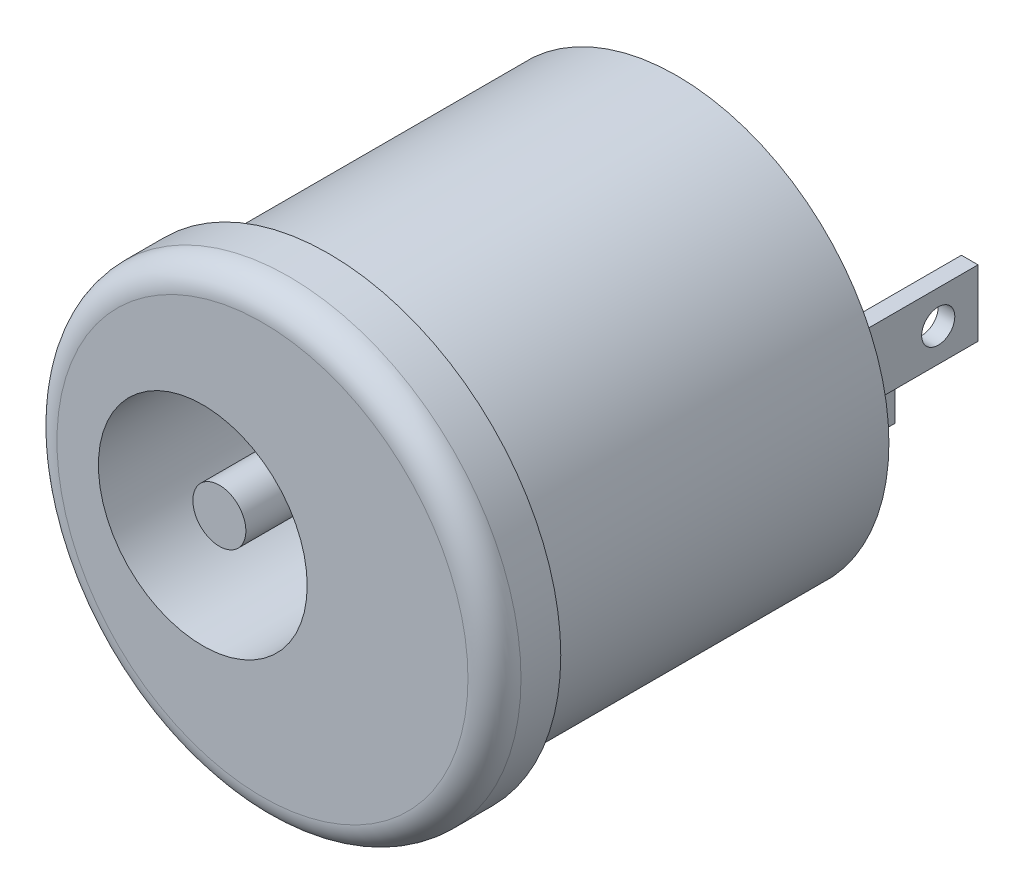
ISO-10303-21;
HEADER;
FILE_DESCRIPTION(('STEP AP214'),'2;1');
FILE_NAME('part.step','',(''),(''),'','','');
FILE_SCHEMA(('AUTOMOTIVE_DESIGN { 1 0 10303 214 1 1 1 1 }'));
ENDSEC;
DATA;
#1=APPLICATION_CONTEXT('core data for automotive mechanical design processes');
#2=APPLICATION_PROTOCOL_DEFINITION('international standard','automotive_design',2000,#1);
#3=PRODUCT_CONTEXT('',#1,'mechanical');
#4=PRODUCT('Part','Part','',(#3));
#5=PRODUCT_RELATED_PRODUCT_CATEGORY('part','',(#4));
#6=PRODUCT_DEFINITION_FORMATION('','',#4);
#7=PRODUCT_DEFINITION_CONTEXT('part definition',#1,'design');
#8=PRODUCT_DEFINITION('design','',#6,#7);
#9=PRODUCT_DEFINITION_SHAPE('','',#8);
#10=(LENGTH_UNIT() NAMED_UNIT(*) SI_UNIT(.MILLI.,.METRE.));
#11=(NAMED_UNIT(*) PLANE_ANGLE_UNIT() SI_UNIT($,.RADIAN.));
#12=(NAMED_UNIT(*) SI_UNIT($,.STERADIAN.) SOLID_ANGLE_UNIT());
#13=UNCERTAINTY_MEASURE_WITH_UNIT(LENGTH_MEASURE(1.E-05),#10,'distance_accuracy_value','');
#14=(GEOMETRIC_REPRESENTATION_CONTEXT(3) GLOBAL_UNCERTAINTY_ASSIGNED_CONTEXT((#13)) GLOBAL_UNIT_ASSIGNED_CONTEXT((#10,
#11,#12)) REPRESENTATION_CONTEXT('',''));
#15=CARTESIAN_POINT('',(0.,0.,0.));
#16=DIRECTION('',(0.,0.,1.));
#17=DIRECTION('',(1.,0.,0.));
#18=AXIS2_PLACEMENT_3D('',#15,#16,#17);
#19=CARTESIAN_POINT('',(0.,0.,0.));
#20=DIRECTION('',(0.,0.,1.));
#21=DIRECTION('',(1.,0.,0.));
#22=AXIS2_PLACEMENT_3D('',#19,#20,#21);
#23=PLANE('',#22);
#24=DIRECTION('',(0.,-1.,0.));
#25=VECTOR('',#24,1.);
#26=CARTESIAN_POINT('',(4.08743958634496,1.,0.));
#27=LINE('',#26,#25);
#28=CARTESIAN_POINT('',(4.08743958634496,1.,0.));
#29=VERTEX_POINT('',#28);
#30=CARTESIAN_POINT('',(4.08743958634497,-1.,0.));
#31=VERTEX_POINT('',#30);
#32=EDGE_CURVE('E122',#29,#31,#27,.T.);
#33=ORIENTED_EDGE('',*,*,#32,.F.);
#34=DIRECTION('',(1.,0.,0.));
#35=VECTOR('',#34,1.);
#36=CARTESIAN_POINT('',(3.58743958634497,1.00000000000001,0.));
#37=LINE('',#36,#35);
#38=CARTESIAN_POINT('',(3.58743958634497,1.00000000000001,0.));
#39=VERTEX_POINT('',#38);
#40=EDGE_CURVE('E135',#39,#29,#37,.T.);
#41=ORIENTED_EDGE('',*,*,#40,.F.);
#42=DIRECTION('',(0.,1.,0.));
#43=VECTOR('',#42,1.);
#44=CARTESIAN_POINT('',(3.58743958634497,1.00000000000001,0.));
#45=LINE('',#44,#43);
#46=CARTESIAN_POINT('',(3.58743958634497,-0.999999999999987,0.));
#47=VERTEX_POINT('',#46);
#48=EDGE_CURVE('E144',#47,#39,#45,.T.);
#49=ORIENTED_EDGE('',*,*,#48,.F.);
#50=DIRECTION('',(-1.,0.,0.));
#51=VECTOR('',#50,1.);
#52=CARTESIAN_POINT('',(3.58743958634497,-0.999999999999987,0.));
#53=LINE('',#52,#51);
#54=EDGE_CURVE('E125',#31,#47,#53,.T.);
#55=ORIENTED_EDGE('',*,*,#54,.F.);
#56=EDGE_LOOP('',(#33,#41,#49,#55));
#57=FACE_BOUND('',#56,.T.);
#58=CARTESIAN_POINT('',(0.,0.,0.));
#59=DIRECTION('',(0.,0.,-1.));
#60=DIRECTION('',(-1.,0.,0.));
#61=AXIS2_PLACEMENT_3D('',#58,#59,#60);
#62=CIRCLE('',#61,6.4);
#63=CARTESIAN_POINT('',(-6.4,0.,0.));
#64=VERTEX_POINT('',#63);
#65=EDGE_CURVE('E170',#64,#64,#62,.T.);
#66=ORIENTED_EDGE('',*,*,#65,.T.);
#67=EDGE_LOOP('',(#66));
#68=FACE_BOUND('',#67,.T.);
#69=DIRECTION('',(0.,-1.,0.));
#70=VECTOR('',#69,1.);
#71=CARTESIAN_POINT('',(1.58722757224793,-2.38993561947143,0.));
#72=LINE('',#71,#70);
#73=CARTESIAN_POINT('',(1.58722757224793,-2.38993561947143,0.));
#74=VERTEX_POINT('',#73);
#75=CARTESIAN_POINT('',(1.58722757224794,-4.38993561947143,0.));
#76=VERTEX_POINT('',#75);
#77=EDGE_CURVE('E121',#74,#76,#72,.T.);
#78=ORIENTED_EDGE('',*,*,#77,.F.);
#79=DIRECTION('',(1.,0.,0.));
#80=VECTOR('',#79,1.);
#81=CARTESIAN_POINT('',(1.08722757224794,-2.38993561947143,0.));
#82=LINE('',#81,#80);
#83=CARTESIAN_POINT('',(1.08722757224794,-2.38993561947143,0.));
#84=VERTEX_POINT('',#83);
#85=EDGE_CURVE('E118',#84,#74,#82,.T.);
#86=ORIENTED_EDGE('',*,*,#85,.F.);
#87=DIRECTION('',(0.,1.,0.));
#88=VECTOR('',#87,1.);
#89=CARTESIAN_POINT('',(1.08722757224794,-2.38993561947143,0.));
#90=LINE('',#89,#88);
#91=CARTESIAN_POINT('',(1.08722757224794,-4.38993561947142,0.));
#92=VERTEX_POINT('',#91);
#93=EDGE_CURVE('E56',#92,#84,#90,.T.);
#94=ORIENTED_EDGE('',*,*,#93,.F.);
#95=DIRECTION('',(-1.,0.,0.));
#96=VECTOR('',#95,1.);
#97=CARTESIAN_POINT('',(1.08722757224794,-4.38993561947142,0.));
#98=LINE('',#97,#96);
#99=EDGE_CURVE('E51',#76,#92,#98,.T.);
#100=ORIENTED_EDGE('',*,*,#99,.F.);
#101=EDGE_LOOP('',(#78,#86,#94,#100));
#102=FACE_BOUND('',#101,.T.);
#103=ADVANCED_FACE('F36',(#57,#68,#102),#23,.F.);
#104=CARTESIAN_POINT('',(-1.8,0.,3.5));
#105=DIRECTION('',(0.,0.,1.));
#106=DIRECTION('',(1.,0.,0.));
#107=AXIS2_PLACEMENT_3D('',#104,#105,#106);
#108=PLANE('',#107);
#109=CARTESIAN_POINT('',(-1.8,0.,3.5));
#110=DIRECTION('',(0.,0.,1.));
#111=DIRECTION('',(1.,0.,0.));
#112=AXIS2_PLACEMENT_3D('',#109,#110,#111);
#113=CIRCLE('',#112,3.15);
#114=CARTESIAN_POINT('',(1.35,0.,3.5));
#115=VERTEX_POINT('',#114);
#116=EDGE_CURVE('E167',#115,#115,#113,.T.);
#117=ORIENTED_EDGE('',*,*,#116,.T.);
#118=EDGE_LOOP('',(#117));
#119=FACE_BOUND('',#118,.T.);
#120=CARTESIAN_POINT('',(-1.8,0.,3.5));
#121=DIRECTION('',(0.,0.,1.));
#122=DIRECTION('',(1.,0.,0.));
#123=AXIS2_PLACEMENT_3D('',#120,#121,#122);
#124=CIRCLE('',#123,0.8);
#125=CARTESIAN_POINT('',(-1.,0.,3.5));
#126=VERTEX_POINT('',#125);
#127=EDGE_CURVE('E160',#126,#126,#124,.T.);
#128=ORIENTED_EDGE('',*,*,#127,.F.);
#129=EDGE_LOOP('',(#128));
#130=FACE_BOUND('',#129,.T.);
#131=ADVANCED_FACE('F205',(#119,#130),#108,.T.);
#132=CARTESIAN_POINT('',(0.,0.,12.5));
#133=DIRECTION('',(0.,0.,-1.));
#134=DIRECTION('',(-1.,0.,0.));
#135=AXIS2_PLACEMENT_3D('',#132,#133,#134);
#136=CYLINDRICAL_SURFACE('',#135,7.);
#137=CARTESIAN_POINT('',(0.,0.,11.7));
#138=DIRECTION('',(0.,0.,1.));
#139=DIRECTION('',(1.,0.,0.));
#140=AXIS2_PLACEMENT_3D('',#137,#138,#139);
#141=CIRCLE('',#140,7.);
#142=CARTESIAN_POINT('',(7.,0.,11.7));
#143=VERTEX_POINT('',#142);
#144=EDGE_CURVE('E11',#143,#143,#141,.F.);
#145=ORIENTED_EDGE('',*,*,#144,.T.);
#146=EDGE_LOOP('',(#145));
#147=FACE_BOUND('',#146,.T.);
#148=CARTESIAN_POINT('',(0.,0.,10.5));
#149=DIRECTION('',(0.,0.,-1.));
#150=DIRECTION('',(-1.,0.,0.));
#151=AXIS2_PLACEMENT_3D('',#148,#149,#150);
#152=CIRCLE('',#151,7.);
#153=CARTESIAN_POINT('',(-7.,0.,10.5));
#154=VERTEX_POINT('',#153);
#155=EDGE_CURVE('E176',#154,#154,#152,.T.);
#156=ORIENTED_EDGE('',*,*,#155,.F.);
#157=EDGE_LOOP('',(#156));
#158=FACE_BOUND('',#157,.T.);
#159=ADVANCED_FACE('F211',(#147,#158),#136,.T.);
#160=CARTESIAN_POINT('',(0.,0.,12.5));
#161=DIRECTION('',(0.,0.,1.));
#162=DIRECTION('',(1.,0.,0.));
#163=AXIS2_PLACEMENT_3D('',#160,#161,#162);
#164=PLANE('',#163);
#165=CARTESIAN_POINT('',(0.,0.,12.5));
#166=DIRECTION('',(0.,0.,1.));
#167=DIRECTION('',(1.,0.,0.));
#168=AXIS2_PLACEMENT_3D('',#165,#166,#167);
#169=CIRCLE('',#168,6.2);
#170=CARTESIAN_POINT('',(6.2,0.,12.5));
#171=VERTEX_POINT('',#170);
#172=EDGE_CURVE('E44',#171,#171,#169,.T.);
#173=ORIENTED_EDGE('',*,*,#172,.T.);
#174=EDGE_LOOP('',(#173));
#175=FACE_BOUND('',#174,.T.);
#176=CARTESIAN_POINT('',(-1.8,0.,12.5));
#177=DIRECTION('',(0.,0.,1.));
#178=DIRECTION('',(1.,0.,0.));
#179=AXIS2_PLACEMENT_3D('',#176,#177,#178);
#180=CIRCLE('',#179,3.15);
#181=CARTESIAN_POINT('',(1.35,0.,12.5));
#182=VERTEX_POINT('',#181);
#183=EDGE_CURVE('E164',#182,#182,#180,.T.);
#184=ORIENTED_EDGE('',*,*,#183,.F.);
#185=EDGE_LOOP('',(#184));
#186=FACE_BOUND('',#185,.T.);
#187=ADVANCED_FACE('F191',(#175,#186),#164,.T.);
#188=CARTESIAN_POINT('',(0.,0.,10.5));
#189=DIRECTION('',(0.,0.,-1.));
#190=DIRECTION('',(-1.,0.,0.));
#191=AXIS2_PLACEMENT_3D('',#188,#189,#190);
#192=PLANE('',#191);
#193=CARTESIAN_POINT('',(0.,0.,10.5));
#194=DIRECTION('',(0.,0.,-1.));
#195=DIRECTION('',(-1.,0.,0.));
#196=AXIS2_PLACEMENT_3D('',#193,#194,#195);
#197=CIRCLE('',#196,6.4);
#198=CARTESIAN_POINT('',(-6.4,0.,10.5));
#199=VERTEX_POINT('',#198);
#200=EDGE_CURVE('E173',#199,#199,#197,.T.);
#201=ORIENTED_EDGE('',*,*,#200,.F.);
#202=EDGE_LOOP('',(#201));
#203=FACE_BOUND('',#202,.T.);
#204=ORIENTED_EDGE('',*,*,#155,.T.);
#205=EDGE_LOOP('',(#204));
#206=FACE_BOUND('',#205,.T.);
#207=ADVANCED_FACE('F222',(#203,#206),#192,.T.);
#208=CARTESIAN_POINT('',(0.,0.,10.5));
#209=DIRECTION('',(0.,0.,-1.));
#210=DIRECTION('',(-1.,0.,0.));
#211=AXIS2_PLACEMENT_3D('',#208,#209,#210);
#212=CYLINDRICAL_SURFACE('',#211,6.4);
#213=ORIENTED_EDGE('',*,*,#200,.T.);
#214=EDGE_LOOP('',(#213));
#215=FACE_BOUND('',#214,.T.);
#216=ORIENTED_EDGE('',*,*,#65,.F.);
#217=EDGE_LOOP('',(#216));
#218=FACE_BOUND('',#217,.T.);
#219=ADVANCED_FACE('F227',(#215,#218),#212,.T.);
#220=CARTESIAN_POINT('',(-1.8,0.,3.5));
#221=DIRECTION('',(0.,0.,1.));
#222=DIRECTION('',(1.,0.,0.));
#223=AXIS2_PLACEMENT_3D('',#220,#221,#222);
#224=CYLINDRICAL_SURFACE('',#223,3.15);
#225=ORIENTED_EDGE('',*,*,#116,.F.);
#226=EDGE_LOOP('',(#225));
#227=FACE_BOUND('',#226,.T.);
#228=ORIENTED_EDGE('',*,*,#183,.T.);
#229=EDGE_LOOP('',(#228));
#230=FACE_BOUND('',#229,.T.);
#231=ADVANCED_FACE('F232',(#227,#230),#224,.F.);
#232=CARTESIAN_POINT('',(-1.8,0.,12.));
#233=DIRECTION('',(0.,0.,-1.));
#234=DIRECTION('',(-1.,0.,0.));
#235=AXIS2_PLACEMENT_3D('',#232,#233,#234);
#236=CYLINDRICAL_SURFACE('',#235,0.8);
#237=CARTESIAN_POINT('',(-1.8,0.,12.));
#238=DIRECTION('',(0.,0.,1.));
#239=DIRECTION('',(1.,0.,0.));
#240=AXIS2_PLACEMENT_3D('',#237,#238,#239);
#241=CIRCLE('',#240,0.8);
#242=CARTESIAN_POINT('',(-1.,0.,12.));
#243=VERTEX_POINT('',#242);
#244=EDGE_CURVE('E161',#243,#243,#241,.T.);
#245=ORIENTED_EDGE('',*,*,#244,.F.);
#246=EDGE_LOOP('',(#245));
#247=FACE_BOUND('',#246,.T.);
#248=ORIENTED_EDGE('',*,*,#127,.T.);
#249=EDGE_LOOP('',(#248));
#250=FACE_BOUND('',#249,.T.);
#251=ADVANCED_FACE('F238',(#247,#250),#236,.T.);
#252=CARTESIAN_POINT('',(-1.8,0.,12.));
#253=DIRECTION('',(0.,0.,1.));
#254=DIRECTION('',(1.,0.,0.));
#255=AXIS2_PLACEMENT_3D('',#252,#253,#254);
#256=PLANE('',#255);
#257=ORIENTED_EDGE('',*,*,#244,.T.);
#258=EDGE_LOOP('',(#257));
#259=FACE_BOUND('',#258,.T.);
#260=ADVANCED_FACE('F243',(#259),#256,.T.);
#261=CARTESIAN_POINT('',(4.08743958634496,1.,-5.));
#262=DIRECTION('',(-1.,0.,0.));
#263=DIRECTION('',(0.,0.,1.));
#264=AXIS2_PLACEMENT_3D('',#261,#262,#263);
#265=PLANE('',#264);
#266=CARTESIAN_POINT('',(4.08743958634497,0.,-3.8));
#267=DIRECTION('',(1.,0.,0.));
#268=DIRECTION('',(0.,0.,-1.));
#269=AXIS2_PLACEMENT_3D('',#266,#267,#268);
#270=CIRCLE('',#269,0.500000000000001);
#271=CARTESIAN_POINT('',(4.08743958634497,0.,-4.3));
#272=VERTEX_POINT('',#271);
#273=EDGE_CURVE('E187',#272,#272,#270,.T.);
#274=ORIENTED_EDGE('',*,*,#273,.F.);
#275=EDGE_LOOP('',(#274));
#276=FACE_BOUND('',#275,.T.);
#277=ORIENTED_EDGE('',*,*,#32,.T.);
#278=DIRECTION('',(0.,0.,1.));
#279=VECTOR('',#278,1.);
#280=CARTESIAN_POINT('',(4.08743958634497,-1.,-5.));
#281=LINE('',#280,#279);
#282=CARTESIAN_POINT('',(4.08743958634497,-1.,-5.));
#283=VERTEX_POINT('',#282);
#284=EDGE_CURVE('E157',#283,#31,#281,.T.);
#285=ORIENTED_EDGE('',*,*,#284,.F.);
#286=DIRECTION('',(0.,-1.,0.));
#287=VECTOR('',#286,1.);
#288=CARTESIAN_POINT('',(4.08743958634496,1.,-5.));
#289=LINE('',#288,#287);
#290=CARTESIAN_POINT('',(4.08743958634496,1.,-5.));
#291=VERTEX_POINT('',#290);
#292=EDGE_CURVE('E131',#291,#283,#289,.T.);
#293=ORIENTED_EDGE('',*,*,#292,.F.);
#294=DIRECTION('',(0.,0.,1.));
#295=VECTOR('',#294,1.);
#296=CARTESIAN_POINT('',(4.08743958634496,1.,-5.));
#297=LINE('',#296,#295);
#298=EDGE_CURVE('E140',#291,#29,#297,.T.);
#299=ORIENTED_EDGE('',*,*,#298,.T.);
#300=EDGE_LOOP('',(#277,#285,#293,#299));
#301=FACE_BOUND('',#300,.T.);
#302=ADVANCED_FACE('F247',(#276,#301),#265,.F.);
#303=CARTESIAN_POINT('',(3.58743958634497,-0.999999999999987,-5.));
#304=DIRECTION('',(0.,1.,0.));
#305=DIRECTION('',(0.,0.,1.));
#306=AXIS2_PLACEMENT_3D('',#303,#304,#305);
#307=PLANE('',#306);
#308=ORIENTED_EDGE('',*,*,#54,.T.);
#309=DIRECTION('',(0.,0.,1.));
#310=VECTOR('',#309,1.);
#311=CARTESIAN_POINT('',(3.58743958634497,-0.999999999999987,-5.));
#312=LINE('',#311,#310);
#313=CARTESIAN_POINT('',(3.58743958634497,-0.999999999999987,-5.));
#314=VERTEX_POINT('',#313);
#315=EDGE_CURVE('E154',#314,#47,#312,.T.);
#316=ORIENTED_EDGE('',*,*,#315,.F.);
#317=DIRECTION('',(-1.,0.,0.));
#318=VECTOR('',#317,1.);
#319=CARTESIAN_POINT('',(3.58743958634497,-0.999999999999987,-5.));
#320=LINE('',#319,#318);
#321=EDGE_CURVE('E134',#283,#314,#320,.T.);
#322=ORIENTED_EDGE('',*,*,#321,.F.);
#323=ORIENTED_EDGE('',*,*,#284,.T.);
#324=EDGE_LOOP('',(#308,#316,#322,#323));
#325=FACE_BOUND('',#324,.T.);
#326=ADVANCED_FACE('F251',(#325),#307,.F.);
#327=CARTESIAN_POINT('',(3.58743958634497,1.00000000000001,-5.));
#328=DIRECTION('',(1.,0.,0.));
#329=DIRECTION('',(0.,0.,-1.));
#330=AXIS2_PLACEMENT_3D('',#327,#328,#329);
#331=PLANE('',#330);
#332=CARTESIAN_POINT('',(3.58743958634497,0.,-3.8));
#333=DIRECTION('',(1.,0.,0.));
#334=DIRECTION('',(0.,0.,-1.));
#335=AXIS2_PLACEMENT_3D('',#332,#333,#334);
#336=CIRCLE('',#335,0.500000000000001);
#337=CARTESIAN_POINT('',(3.58743958634497,0.,-4.3));
#338=VERTEX_POINT('',#337);
#339=EDGE_CURVE('E185',#338,#338,#336,.T.);
#340=ORIENTED_EDGE('',*,*,#339,.T.);
#341=EDGE_LOOP('',(#340));
#342=FACE_BOUND('',#341,.T.);
#343=ORIENTED_EDGE('',*,*,#48,.T.);
#344=DIRECTION('',(0.,0.,1.));
#345=VECTOR('',#344,1.);
#346=CARTESIAN_POINT('',(3.58743958634497,1.00000000000001,-5.));
#347=LINE('',#346,#345);
#348=CARTESIAN_POINT('',(3.58743958634497,1.00000000000001,-5.));
#349=VERTEX_POINT('',#348);
#350=EDGE_CURVE('E151',#349,#39,#347,.T.);
#351=ORIENTED_EDGE('',*,*,#350,.F.);
#352=DIRECTION('',(0.,1.,0.));
#353=VECTOR('',#352,1.);
#354=CARTESIAN_POINT('',(3.58743958634497,1.00000000000001,-5.));
#355=LINE('',#354,#353);
#356=EDGE_CURVE('E137',#314,#349,#355,.T.);
#357=ORIENTED_EDGE('',*,*,#356,.F.);
#358=ORIENTED_EDGE('',*,*,#315,.T.);
#359=EDGE_LOOP('',(#343,#351,#357,#358));
#360=FACE_BOUND('',#359,.T.);
#361=ADVANCED_FACE('F255',(#342,#360),#331,.F.);
#362=CARTESIAN_POINT('',(3.58743958634497,1.00000000000001,-5.));
#363=DIRECTION('',(0.,-1.,0.));
#364=DIRECTION('',(0.,0.,-1.));
#365=AXIS2_PLACEMENT_3D('',#362,#363,#364);
#366=PLANE('',#365);
#367=ORIENTED_EDGE('',*,*,#40,.T.);
#368=ORIENTED_EDGE('',*,*,#298,.F.);
#369=DIRECTION('',(1.,0.,0.));
#370=VECTOR('',#369,1.);
#371=CARTESIAN_POINT('',(3.58743958634497,1.00000000000001,-5.));
#372=LINE('',#371,#370);
#373=EDGE_CURVE('E139',#349,#291,#372,.T.);
#374=ORIENTED_EDGE('',*,*,#373,.F.);
#375=ORIENTED_EDGE('',*,*,#350,.T.);
#376=EDGE_LOOP('',(#367,#368,#374,#375));
#377=FACE_BOUND('',#376,.T.);
#378=ADVANCED_FACE('F259',(#377),#366,.F.);
#379=CARTESIAN_POINT('',(0.,0.,-5.));
#380=DIRECTION('',(0.,0.,1.));
#381=DIRECTION('',(1.,0.,0.));
#382=AXIS2_PLACEMENT_3D('',#379,#380,#381);
#383=PLANE('',#382);
#384=ORIENTED_EDGE('',*,*,#292,.T.);
#385=ORIENTED_EDGE('',*,*,#321,.T.);
#386=ORIENTED_EDGE('',*,*,#356,.T.);
#387=ORIENTED_EDGE('',*,*,#373,.T.);
#388=EDGE_LOOP('',(#384,#385,#386,#387));
#389=FACE_BOUND('',#388,.T.);
#390=ADVANCED_FACE('F263',(#389),#383,.F.);
#391=CARTESIAN_POINT('',(1.58722757224793,-2.38993561947143,-5.));
#392=DIRECTION('',(-1.,0.,0.));
#393=DIRECTION('',(0.,0.,1.));
#394=AXIS2_PLACEMENT_3D('',#391,#392,#393);
#395=PLANE('',#394);
#396=CARTESIAN_POINT('',(1.58722757224794,-3.38993561947143,-3.8));
#397=DIRECTION('',(1.,0.,0.));
#398=DIRECTION('',(0.,0.,-1.));
#399=AXIS2_PLACEMENT_3D('',#396,#397,#398);
#400=CIRCLE('',#399,0.500000000000001);
#401=CARTESIAN_POINT('',(1.58722757224794,-3.38993561947143,-4.3));
#402=VERTEX_POINT('',#401);
#403=EDGE_CURVE('E184',#402,#402,#400,.T.);
#404=ORIENTED_EDGE('',*,*,#403,.F.);
#405=EDGE_LOOP('',(#404));
#406=FACE_BOUND('',#405,.T.);
#407=ORIENTED_EDGE('',*,*,#77,.T.);
#408=DIRECTION('',(0.,0.,1.));
#409=VECTOR('',#408,1.);
#410=CARTESIAN_POINT('',(1.58722757224794,-4.38993561947143,-5.));
#411=LINE('',#410,#409);
#412=CARTESIAN_POINT('',(1.58722757224794,-4.38993561947143,-5.));
#413=VERTEX_POINT('',#412);
#414=EDGE_CURVE('E102',#413,#76,#411,.T.);
#415=ORIENTED_EDGE('',*,*,#414,.F.);
#416=DIRECTION('',(0.,-1.,0.));
#417=VECTOR('',#416,1.);
#418=CARTESIAN_POINT('',(1.58722757224793,-2.38993561947143,-5.));
#419=LINE('',#418,#417);
#420=CARTESIAN_POINT('',(1.58722757224793,-2.38993561947143,-5.));
#421=VERTEX_POINT('',#420);
#422=EDGE_CURVE('E109',#421,#413,#419,.T.);
#423=ORIENTED_EDGE('',*,*,#422,.F.);
#424=DIRECTION('',(0.,0.,1.));
#425=VECTOR('',#424,1.);
#426=CARTESIAN_POINT('',(1.58722757224793,-2.38993561947143,-5.));
#427=LINE('',#426,#425);
#428=EDGE_CURVE('E296',#421,#74,#427,.T.);
#429=ORIENTED_EDGE('',*,*,#428,.T.);
#430=EDGE_LOOP('',(#407,#415,#423,#429));
#431=FACE_BOUND('',#430,.T.);
#432=ADVANCED_FACE('F120',(#406,#431),#395,.F.);
#433=CARTESIAN_POINT('',(1.08722757224794,-4.38993561947142,-5.));
#434=DIRECTION('',(0.,1.,0.));
#435=DIRECTION('',(0.,0.,1.));
#436=AXIS2_PLACEMENT_3D('',#433,#434,#435);
#437=PLANE('',#436);
#438=ORIENTED_EDGE('',*,*,#99,.T.);
#439=DIRECTION('',(0.,0.,1.));
#440=VECTOR('',#439,1.);
#441=CARTESIAN_POINT('',(1.08722757224794,-4.38993561947142,-5.));
#442=LINE('',#441,#440);
#443=CARTESIAN_POINT('',(1.08722757224794,-4.38993561947142,-5.));
#444=VERTEX_POINT('',#443);
#445=EDGE_CURVE('E105',#444,#92,#442,.T.);
#446=ORIENTED_EDGE('',*,*,#445,.F.);
#447=DIRECTION('',(-1.,0.,0.));
#448=VECTOR('',#447,1.);
#449=CARTESIAN_POINT('',(1.08722757224794,-4.38993561947142,-5.));
#450=LINE('',#449,#448);
#451=EDGE_CURVE('E98',#413,#444,#450,.T.);
#452=ORIENTED_EDGE('',*,*,#451,.F.);
#453=ORIENTED_EDGE('',*,*,#414,.T.);
#454=EDGE_LOOP('',(#438,#446,#452,#453));
#455=FACE_BOUND('',#454,.T.);
#456=ADVANCED_FACE('F100',(#455),#437,.F.);
#457=CARTESIAN_POINT('',(1.08722757224794,-2.38993561947143,-5.));
#458=DIRECTION('',(1.,0.,0.));
#459=DIRECTION('',(0.,1.,0.));
#460=AXIS2_PLACEMENT_3D('',#457,#458,#459);
#461=PLANE('',#460);
#462=CARTESIAN_POINT('',(1.08722757224793,-3.38993561947143,-3.8));
#463=DIRECTION('',(1.,0.,0.));
#464=DIRECTION('',(0.,1.,0.));
#465=AXIS2_PLACEMENT_3D('',#462,#463,#464);
#466=CIRCLE('',#465,0.500000000000001);
#467=CARTESIAN_POINT('',(1.08722757224793,-2.88993561947143,-3.8));
#468=VERTEX_POINT('',#467);
#469=EDGE_CURVE('E181',#468,#468,#466,.T.);
#470=ORIENTED_EDGE('',*,*,#469,.T.);
#471=EDGE_LOOP('',(#470));
#472=FACE_BOUND('',#471,.T.);
#473=ORIENTED_EDGE('',*,*,#93,.T.);
#474=DIRECTION('',(0.,0.,1.));
#475=VECTOR('',#474,1.);
#476=CARTESIAN_POINT('',(1.08722757224794,-2.38993561947143,-5.));
#477=LINE('',#476,#475);
#478=CARTESIAN_POINT('',(1.08722757224794,-2.38993561947143,-5.));
#479=VERTEX_POINT('',#478);
#480=EDGE_CURVE('E127',#479,#84,#477,.T.);
#481=ORIENTED_EDGE('',*,*,#480,.F.);
#482=DIRECTION('',(0.,1.,0.));
#483=VECTOR('',#482,1.);
#484=CARTESIAN_POINT('',(1.08722757224794,-2.38993561947143,-5.));
#485=LINE('',#484,#483);
#486=EDGE_CURVE('E108',#444,#479,#485,.T.);
#487=ORIENTED_EDGE('',*,*,#486,.F.);
#488=ORIENTED_EDGE('',*,*,#445,.T.);
#489=EDGE_LOOP('',(#473,#481,#487,#488));
#490=FACE_BOUND('',#489,.T.);
#491=ADVANCED_FACE('F273',(#472,#490),#461,.F.);
#492=CARTESIAN_POINT('',(1.08722757224794,-2.38993561947143,-5.));
#493=DIRECTION('',(0.,-1.,0.));
#494=DIRECTION('',(0.,0.,-1.));
#495=AXIS2_PLACEMENT_3D('',#492,#493,#494);
#496=PLANE('',#495);
#497=ORIENTED_EDGE('',*,*,#85,.T.);
#498=ORIENTED_EDGE('',*,*,#428,.F.);
#499=DIRECTION('',(1.,0.,0.));
#500=VECTOR('',#499,1.);
#501=CARTESIAN_POINT('',(1.08722757224794,-2.38993561947143,-5.));
#502=LINE('',#501,#500);
#503=EDGE_CURVE('E114',#479,#421,#502,.T.);
#504=ORIENTED_EDGE('',*,*,#503,.F.);
#505=ORIENTED_EDGE('',*,*,#480,.T.);
#506=EDGE_LOOP('',(#497,#498,#504,#505));
#507=FACE_BOUND('',#506,.T.);
#508=ADVANCED_FACE('F276',(#507),#496,.F.);
#509=CARTESIAN_POINT('',(0.,0.,-5.));
#510=DIRECTION('',(0.,0.,1.));
#511=DIRECTION('',(1.,0.,0.));
#512=AXIS2_PLACEMENT_3D('',#509,#510,#511);
#513=PLANE('',#512);
#514=ORIENTED_EDGE('',*,*,#422,.T.);
#515=ORIENTED_EDGE('',*,*,#451,.T.);
#516=ORIENTED_EDGE('',*,*,#486,.T.);
#517=ORIENTED_EDGE('',*,*,#503,.T.);
#518=EDGE_LOOP('',(#514,#515,#516,#517));
#519=FACE_BOUND('',#518,.T.);
#520=ADVANCED_FACE('F112',(#519),#513,.F.);
#521=CARTESIAN_POINT('',(-7.,-3.38993561947143,-3.8));
#522=DIRECTION('',(1.,0.,0.));
#523=DIRECTION('',(0.,0.,-1.));
#524=AXIS2_PLACEMENT_3D('',#521,#522,#523);
#525=CYLINDRICAL_SURFACE('',#524,0.500000000000001);
#526=ORIENTED_EDGE('',*,*,#403,.T.);
#527=EDGE_LOOP('',(#526));
#528=FACE_BOUND('',#527,.T.);
#529=ORIENTED_EDGE('',*,*,#469,.F.);
#530=EDGE_LOOP('',(#529));
#531=FACE_BOUND('',#530,.T.);
#532=ADVANCED_FACE('F200',(#528,#531),#525,.F.);
#533=CARTESIAN_POINT('',(-7.,0.,-3.8));
#534=DIRECTION('',(1.,0.,0.));
#535=DIRECTION('',(0.,0.,-1.));
#536=AXIS2_PLACEMENT_3D('',#533,#534,#535);
#537=CYLINDRICAL_SURFACE('',#536,0.500000000000001);
#538=ORIENTED_EDGE('',*,*,#273,.T.);
#539=EDGE_LOOP('',(#538));
#540=FACE_BOUND('',#539,.T.);
#541=ORIENTED_EDGE('',*,*,#339,.F.);
#542=EDGE_LOOP('',(#541));
#543=FACE_BOUND('',#542,.T.);
#544=ADVANCED_FACE('F195',(#540,#543),#537,.F.);
#545=CARTESIAN_POINT('',(0.,0.,11.7));
#546=DIRECTION('',(0.,0.,1.));
#547=DIRECTION('',(1.,0.,0.));
#548=AXIS2_PLACEMENT_3D('',#545,#546,#547);
#549=TOROIDAL_SURFACE('',#548,6.2,0.8);
#550=ORIENTED_EDGE('',*,*,#144,.F.);
#551=EDGE_LOOP('',(#550));
#552=FACE_BOUND('',#551,.T.);
#553=ORIENTED_EDGE('',*,*,#172,.F.);
#554=EDGE_LOOP('',(#553));
#555=FACE_BOUND('',#554,.T.);
#556=ADVANCED_FACE('F38',(#552,#555),#549,.T.);
#557=CLOSED_SHELL('',(#103,#131,#159,#187,#207,#219,#231,#251,#260,#302,#326,#361,#378,#390,
#432,#456,#491,#508,#520,#532,#544,#556));
#558=MANIFOLD_SOLID_BREP('B2',#557);
#559=ADVANCED_BREP_SHAPE_REPRESENTATION('',(#18,#558),#14);
#560=SHAPE_DEFINITION_REPRESENTATION(#9,#559);
ENDSEC;
END-ISO-10303-21;
